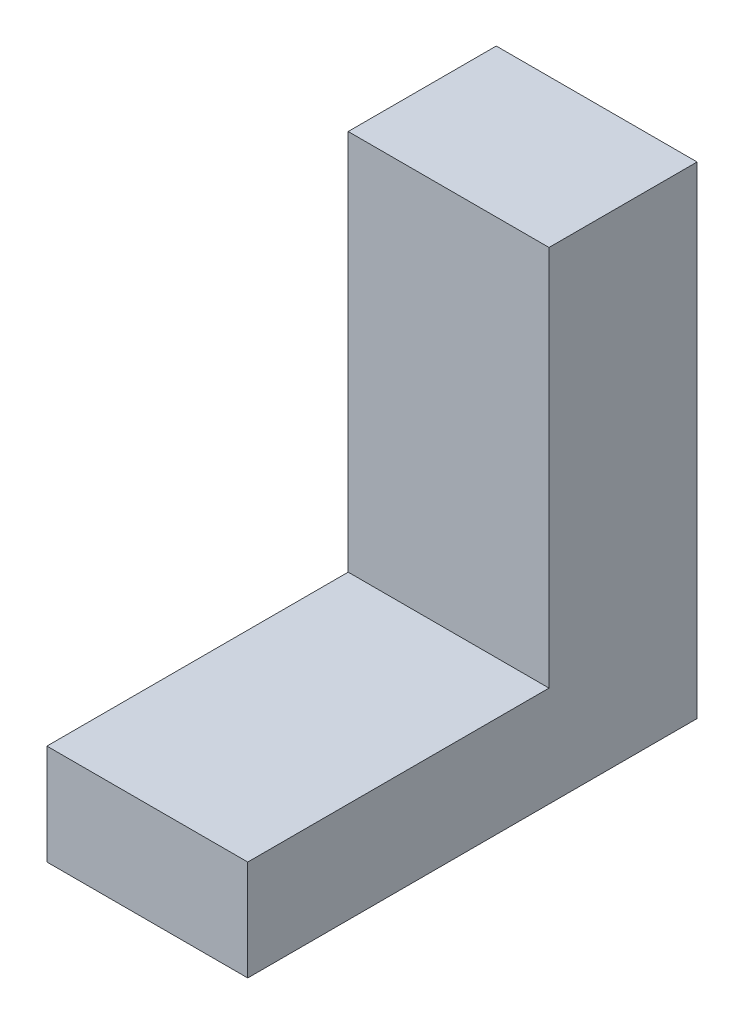
ISO-10303-21;
HEADER;
FILE_DESCRIPTION(('STEP AP214'),'2;1');
FILE_NAME('part.step','',(''),(''),'','','');
FILE_SCHEMA(('AUTOMOTIVE_DESIGN { 1 0 10303 214 1 1 1 1 }'));
ENDSEC;
DATA;
#1=APPLICATION_CONTEXT('core data for automotive mechanical design processes');
#2=APPLICATION_PROTOCOL_DEFINITION('international standard','automotive_design',2000,#1);
#3=PRODUCT_CONTEXT('',#1,'mechanical');
#4=PRODUCT('Part','Part','',(#3));
#5=PRODUCT_RELATED_PRODUCT_CATEGORY('part','',(#4));
#6=PRODUCT_DEFINITION_FORMATION('','',#4);
#7=PRODUCT_DEFINITION_CONTEXT('part definition',#1,'design');
#8=PRODUCT_DEFINITION('design','',#6,#7);
#9=PRODUCT_DEFINITION_SHAPE('','',#8);
#10=(LENGTH_UNIT() NAMED_UNIT(*) SI_UNIT(.MILLI.,.METRE.));
#11=(NAMED_UNIT(*) PLANE_ANGLE_UNIT() SI_UNIT($,.RADIAN.));
#12=(NAMED_UNIT(*) SI_UNIT($,.STERADIAN.) SOLID_ANGLE_UNIT());
#13=UNCERTAINTY_MEASURE_WITH_UNIT(LENGTH_MEASURE(1.E-05),#10,'distance_accuracy_value','');
#14=(GEOMETRIC_REPRESENTATION_CONTEXT(3) GLOBAL_UNCERTAINTY_ASSIGNED_CONTEXT((#13)) GLOBAL_UNIT_ASSIGNED_CONTEXT((#10,
#11,#12)) REPRESENTATION_CONTEXT('',''));
#15=CARTESIAN_POINT('',(0.,0.,0.));
#16=DIRECTION('',(0.,0.,1.));
#17=DIRECTION('',(1.,0.,0.));
#18=AXIS2_PLACEMENT_3D('',#15,#16,#17);
#19=CARTESIAN_POINT('',(508.,0.,0.));
#20=DIRECTION('',(0.,0.,-1.));
#21=DIRECTION('',(0.,1.,0.));
#22=AXIS2_PLACEMENT_3D('',#19,#20,#21);
#23=PLANE('',#22);
#24=DIRECTION('',(0.,-1.,0.));
#25=VECTOR('',#24,1.);
#26=CARTESIAN_POINT('',(0.,0.,0.));
#27=LINE('',#26,#25);
#28=CARTESIAN_POINT('',(0.,965.2,0.));
#29=VERTEX_POINT('',#28);
#30=CARTESIAN_POINT('',(0.,0.,0.));
#31=VERTEX_POINT('',#30);
#32=EDGE_CURVE('E125',#29,#31,#27,.T.);
#33=ORIENTED_EDGE('',*,*,#32,.T.);
#34=DIRECTION('',(-1.,0.,0.));
#35=VECTOR('',#34,1.);
#36=CARTESIAN_POINT('',(508.,0.,0.));
#37=LINE('',#36,#35);
#38=CARTESIAN_POINT('',(508.,0.,0.));
#39=VERTEX_POINT('',#38);
#40=EDGE_CURVE('E11',#39,#31,#37,.T.);
#41=ORIENTED_EDGE('',*,*,#40,.F.);
#42=DIRECTION('',(0.,-1.,0.));
#43=VECTOR('',#42,1.);
#44=CARTESIAN_POINT('',(508.,0.,0.));
#45=LINE('',#44,#43);
#46=CARTESIAN_POINT('',(508.,965.2,0.));
#47=VERTEX_POINT('',#46);
#48=EDGE_CURVE('E142',#47,#39,#45,.T.);
#49=ORIENTED_EDGE('',*,*,#48,.F.);
#50=DIRECTION('',(-1.,0.,0.));
#51=VECTOR('',#50,1.);
#52=CARTESIAN_POINT('',(508.,965.2,0.));
#53=LINE('',#52,#51);
#54=EDGE_CURVE('E121',#47,#29,#53,.T.);
#55=ORIENTED_EDGE('',*,*,#54,.T.);
#56=EDGE_LOOP('',(#33,#41,#49,#55));
#57=FACE_BOUND('',#56,.T.);
#58=ADVANCED_FACE('F37',(#57),#23,.F.);
#59=CARTESIAN_POINT('',(508.,0.,0.));
#60=DIRECTION('',(0.,-1.,0.));
#61=DIRECTION('',(0.,0.,-1.));
#62=AXIS2_PLACEMENT_3D('',#59,#60,#61);
#63=PLANE('',#62);
#64=DIRECTION('',(0.,0.,1.));
#65=VECTOR('',#64,1.);
#66=CARTESIAN_POINT('',(0.,0.,0.));
#67=LINE('',#66,#65);
#68=CARTESIAN_POINT('',(0.,0.,762.));
#69=VERTEX_POINT('',#68);
#70=EDGE_CURVE('E129',#31,#69,#67,.T.);
#71=ORIENTED_EDGE('',*,*,#70,.T.);
#72=DIRECTION('',(-1.,0.,0.));
#73=VECTOR('',#72,1.);
#74=CARTESIAN_POINT('',(508.,0.,762.));
#75=LINE('',#74,#73);
#76=CARTESIAN_POINT('',(508.,0.,762.));
#77=VERTEX_POINT('',#76);
#78=EDGE_CURVE('E46',#77,#69,#75,.T.);
#79=ORIENTED_EDGE('',*,*,#78,.F.);
#80=DIRECTION('',(0.,0.,1.));
#81=VECTOR('',#80,1.);
#82=CARTESIAN_POINT('',(508.,0.,0.));
#83=LINE('',#82,#81);
#84=EDGE_CURVE('E91',#39,#77,#83,.T.);
#85=ORIENTED_EDGE('',*,*,#84,.F.);
#86=ORIENTED_EDGE('',*,*,#40,.T.);
#87=EDGE_LOOP('',(#71,#79,#85,#86));
#88=FACE_BOUND('',#87,.T.);
#89=ADVANCED_FACE('F170',(#88),#63,.F.);
#90=CARTESIAN_POINT('',(508.,0.,762.));
#91=DIRECTION('',(0.,0.,-1.));
#92=DIRECTION('',(-1.,0.,0.));
#93=AXIS2_PLACEMENT_3D('',#90,#91,#92);
#94=PLANE('',#93);
#95=DIRECTION('',(0.,-1.,0.));
#96=VECTOR('',#95,1.);
#97=CARTESIAN_POINT('',(0.,0.,762.));
#98=LINE('',#97,#96);
#99=CARTESIAN_POINT('',(0.,-254.,762.));
#100=VERTEX_POINT('',#99);
#101=EDGE_CURVE('E132',#69,#100,#98,.T.);
#102=ORIENTED_EDGE('',*,*,#101,.T.);
#103=DIRECTION('',(-1.,0.,0.));
#104=VECTOR('',#103,1.);
#105=CARTESIAN_POINT('',(508.,-254.,762.));
#106=LINE('',#105,#104);
#107=CARTESIAN_POINT('',(508.,-254.,762.));
#108=VERTEX_POINT('',#107);
#109=EDGE_CURVE('E114',#108,#100,#106,.T.);
#110=ORIENTED_EDGE('',*,*,#109,.F.);
#111=DIRECTION('',(0.,-1.,0.));
#112=VECTOR('',#111,1.);
#113=CARTESIAN_POINT('',(508.,0.,762.));
#114=LINE('',#113,#112);
#115=EDGE_CURVE('E104',#77,#108,#114,.T.);
#116=ORIENTED_EDGE('',*,*,#115,.F.);
#117=ORIENTED_EDGE('',*,*,#78,.T.);
#118=EDGE_LOOP('',(#102,#110,#116,#117));
#119=FACE_BOUND('',#118,.T.);
#120=ADVANCED_FACE('F152',(#119),#94,.F.);
#121=CARTESIAN_POINT('',(508.,-254.,0.));
#122=DIRECTION('',(0.,1.,0.));
#123=DIRECTION('',(0.,0.,1.));
#124=AXIS2_PLACEMENT_3D('',#121,#122,#123);
#125=PLANE('',#124);
#126=DIRECTION('',(0.,0.,-1.));
#127=VECTOR('',#126,1.);
#128=CARTESIAN_POINT('',(0.,-254.,0.));
#129=LINE('',#128,#127);
#130=CARTESIAN_POINT('',(0.,-254.,-374.542372881356));
#131=VERTEX_POINT('',#130);
#132=EDGE_CURVE('E112',#100,#131,#129,.T.);
#133=ORIENTED_EDGE('',*,*,#132,.T.);
#134=DIRECTION('',(-1.,0.,0.));
#135=VECTOR('',#134,1.);
#136=CARTESIAN_POINT('',(508.,-254.,-374.542372881356));
#137=LINE('',#136,#135);
#138=CARTESIAN_POINT('',(508.,-254.,-374.542372881356));
#139=VERTEX_POINT('',#138);
#140=EDGE_CURVE('E110',#139,#131,#137,.T.);
#141=ORIENTED_EDGE('',*,*,#140,.F.);
#142=DIRECTION('',(0.,0.,-1.));
#143=VECTOR('',#142,1.);
#144=CARTESIAN_POINT('',(508.,-254.,0.));
#145=LINE('',#144,#143);
#146=EDGE_CURVE('E98',#108,#139,#145,.T.);
#147=ORIENTED_EDGE('',*,*,#146,.F.);
#148=ORIENTED_EDGE('',*,*,#109,.T.);
#149=EDGE_LOOP('',(#133,#141,#147,#148));
#150=FACE_BOUND('',#149,.T.);
#151=ADVANCED_FACE('F111',(#150),#125,.F.);
#152=CARTESIAN_POINT('',(508.,-254.,-374.542372881356));
#153=DIRECTION('',(0.,0.,1.));
#154=DIRECTION('',(1.,0.,0.));
#155=AXIS2_PLACEMENT_3D('',#152,#153,#154);
#156=PLANE('',#155);
#157=DIRECTION('',(0.,1.,0.));
#158=VECTOR('',#157,1.);
#159=CARTESIAN_POINT('',(0.,-254.,-374.542372881356));
#160=LINE('',#159,#158);
#161=CARTESIAN_POINT('',(0.,965.2,-374.542372881356));
#162=VERTEX_POINT('',#161);
#163=EDGE_CURVE('E77',#131,#162,#160,.T.);
#164=ORIENTED_EDGE('',*,*,#163,.T.);
#165=DIRECTION('',(-1.,0.,0.));
#166=VECTOR('',#165,1.);
#167=CARTESIAN_POINT('',(508.,965.2,-374.542372881356));
#168=LINE('',#167,#166);
#169=CARTESIAN_POINT('',(508.,965.2,-374.542372881356));
#170=VERTEX_POINT('',#169);
#171=EDGE_CURVE('E115',#170,#162,#168,.T.);
#172=ORIENTED_EDGE('',*,*,#171,.F.);
#173=DIRECTION('',(0.,1.,0.));
#174=VECTOR('',#173,1.);
#175=CARTESIAN_POINT('',(508.,-254.,-374.542372881356));
#176=LINE('',#175,#174);
#177=EDGE_CURVE('E102',#139,#170,#176,.T.);
#178=ORIENTED_EDGE('',*,*,#177,.F.);
#179=ORIENTED_EDGE('',*,*,#140,.T.);
#180=EDGE_LOOP('',(#164,#172,#178,#179));
#181=FACE_BOUND('',#180,.T.);
#182=ADVANCED_FACE('F117',(#181),#156,.F.);
#183=CARTESIAN_POINT('',(508.,965.2,0.));
#184=DIRECTION('',(0.,-1.,0.));
#185=DIRECTION('',(0.,0.,-1.));
#186=AXIS2_PLACEMENT_3D('',#183,#184,#185);
#187=PLANE('',#186);
#188=DIRECTION('',(0.,0.,1.));
#189=VECTOR('',#188,1.);
#190=CARTESIAN_POINT('',(0.,965.2,0.));
#191=LINE('',#190,#189);
#192=EDGE_CURVE('E83',#162,#29,#191,.T.);
#193=ORIENTED_EDGE('',*,*,#192,.T.);
#194=ORIENTED_EDGE('',*,*,#54,.F.);
#195=DIRECTION('',(0.,0.,1.));
#196=VECTOR('',#195,1.);
#197=CARTESIAN_POINT('',(508.,965.2,0.));
#198=LINE('',#197,#196);
#199=EDGE_CURVE('E54',#170,#47,#198,.T.);
#200=ORIENTED_EDGE('',*,*,#199,.F.);
#201=ORIENTED_EDGE('',*,*,#171,.T.);
#202=EDGE_LOOP('',(#193,#194,#200,#201));
#203=FACE_BOUND('',#202,.T.);
#204=ADVANCED_FACE('F159',(#203),#187,.F.);
#205=CARTESIAN_POINT('',(508.,0.,0.));
#206=DIRECTION('',(-1.,0.,0.));
#207=DIRECTION('',(0.,0.,1.));
#208=AXIS2_PLACEMENT_3D('',#205,#206,#207);
#209=PLANE('',#208);
#210=ORIENTED_EDGE('',*,*,#48,.T.);
#211=ORIENTED_EDGE('',*,*,#84,.T.);
#212=ORIENTED_EDGE('',*,*,#115,.T.);
#213=ORIENTED_EDGE('',*,*,#146,.T.);
#214=ORIENTED_EDGE('',*,*,#177,.T.);
#215=ORIENTED_EDGE('',*,*,#199,.T.);
#216=EDGE_LOOP('',(#210,#211,#212,#213,#214,#215));
#217=FACE_BOUND('',#216,.T.);
#218=ADVANCED_FACE('F100',(#217),#209,.F.);
#219=CARTESIAN_POINT('',(0.,0.,0.));
#220=DIRECTION('',(-1.,0.,0.));
#221=DIRECTION('',(0.,0.,1.));
#222=AXIS2_PLACEMENT_3D('',#219,#220,#221);
#223=PLANE('',#222);
#224=ORIENTED_EDGE('',*,*,#32,.F.);
#225=ORIENTED_EDGE('',*,*,#192,.F.);
#226=ORIENTED_EDGE('',*,*,#163,.F.);
#227=ORIENTED_EDGE('',*,*,#132,.F.);
#228=ORIENTED_EDGE('',*,*,#101,.F.);
#229=ORIENTED_EDGE('',*,*,#70,.F.);
#230=EDGE_LOOP('',(#224,#225,#226,#227,#228,#229));
#231=FACE_BOUND('',#230,.T.);
#232=ADVANCED_FACE('F155',(#231),#223,.T.);
#233=CLOSED_SHELL('',(#58,#89,#120,#151,#182,#204,#218,#232));
#234=MANIFOLD_SOLID_BREP('B2',#233);
#235=ADVANCED_BREP_SHAPE_REPRESENTATION('',(#18,#234),#14);
#236=SHAPE_DEFINITION_REPRESENTATION(#9,#235);
ENDSEC;
END-ISO-10303-21;
